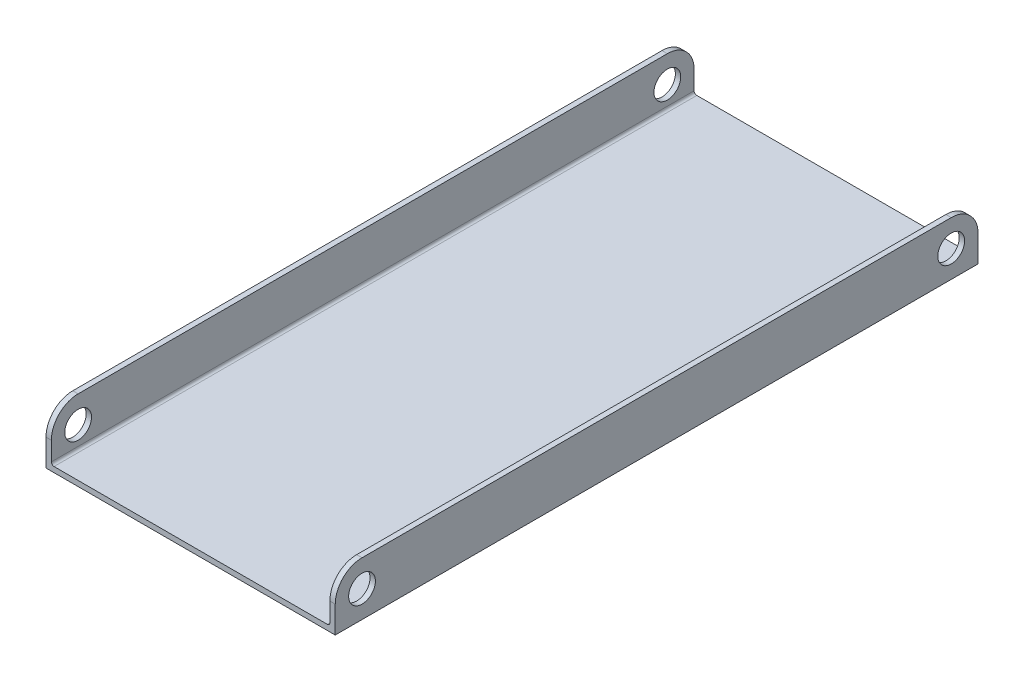
ISO-10303-21;
HEADER;
FILE_DESCRIPTION(('STEP AP214'),'2;1');
FILE_NAME('part.step','',(''),(''),'','','');
FILE_SCHEMA(('AUTOMOTIVE_DESIGN { 1 0 10303 214 1 1 1 1 }'));
ENDSEC;
DATA;
#1=APPLICATION_CONTEXT('core data for automotive mechanical design processes');
#2=APPLICATION_PROTOCOL_DEFINITION('international standard','automotive_design',2000,#1);
#3=PRODUCT_CONTEXT('',#1,'mechanical');
#4=PRODUCT('Part','Part','',(#3));
#5=PRODUCT_RELATED_PRODUCT_CATEGORY('part','',(#4));
#6=PRODUCT_DEFINITION_FORMATION('','',#4);
#7=PRODUCT_DEFINITION_CONTEXT('part definition',#1,'design');
#8=PRODUCT_DEFINITION('design','',#6,#7);
#9=PRODUCT_DEFINITION_SHAPE('','',#8);
#10=(LENGTH_UNIT() NAMED_UNIT(*) SI_UNIT(.MILLI.,.METRE.));
#11=(NAMED_UNIT(*) PLANE_ANGLE_UNIT() SI_UNIT($,.RADIAN.));
#12=(NAMED_UNIT(*) SI_UNIT($,.STERADIAN.) SOLID_ANGLE_UNIT());
#13=UNCERTAINTY_MEASURE_WITH_UNIT(LENGTH_MEASURE(1.E-05),#10,'distance_accuracy_value','');
#14=(GEOMETRIC_REPRESENTATION_CONTEXT(3) GLOBAL_UNCERTAINTY_ASSIGNED_CONTEXT((#13)) GLOBAL_UNIT_ASSIGNED_CONTEXT((#10,
#11,#12)) REPRESENTATION_CONTEXT('',''));
#15=CARTESIAN_POINT('',(0.,0.,0.));
#16=DIRECTION('',(0.,0.,1.));
#17=DIRECTION('',(1.,0.,0.));
#18=AXIS2_PLACEMENT_3D('',#15,#16,#17);
#19=CARTESIAN_POINT('',(0.,6.35,152.4));
#20=DIRECTION('',(0.,1.,0.));
#21=DIRECTION('',(0.,0.,1.));
#22=AXIS2_PLACEMENT_3D('',#19,#20,#21);
#23=PLANE('',#22);
#24=DIRECTION('',(1.,0.,0.));
#25=VECTOR('',#24,1.);
#26=CARTESIAN_POINT('',(-34.29,6.35,146.05));
#27=LINE('',#26,#25);
#28=CARTESIAN_POINT('',(33.02,6.35,146.05));
#29=VERTEX_POINT('',#28);
#30=CARTESIAN_POINT('',(34.29,6.35,146.05));
#31=VERTEX_POINT('',#30);
#32=EDGE_CURVE('E149',#29,#31,#27,.T.);
#33=ORIENTED_EDGE('',*,*,#32,.T.);
#34=DIRECTION('',(0.,0.,-1.));
#35=VECTOR('',#34,1.);
#36=CARTESIAN_POINT('',(34.29,6.35,152.4));
#37=LINE('',#36,#35);
#38=CARTESIAN_POINT('',(34.29,6.35,6.35000000000004));
#39=VERTEX_POINT('',#38);
#40=EDGE_CURVE('E165',#31,#39,#37,.T.);
#41=ORIENTED_EDGE('',*,*,#40,.T.);
#42=DIRECTION('',(1.,0.,0.));
#43=VECTOR('',#42,1.);
#44=CARTESIAN_POINT('',(-34.29,6.35,6.35000000000004));
#45=LINE('',#44,#43);
#46=CARTESIAN_POINT('',(33.02,6.35,6.35000000000004));
#47=VERTEX_POINT('',#46);
#48=EDGE_CURVE('E331',#47,#39,#45,.T.);
#49=ORIENTED_EDGE('',*,*,#48,.F.);
#50=DIRECTION('',(0.,0.,-1.));
#51=VECTOR('',#50,1.);
#52=CARTESIAN_POINT('',(33.02,6.35,152.4));
#53=LINE('',#52,#51);
#54=EDGE_CURVE('E167',#29,#47,#53,.T.);
#55=ORIENTED_EDGE('',*,*,#54,.F.);
#56=EDGE_LOOP('',(#33,#41,#49,#55));
#57=FACE_BOUND('',#56,.T.);
#58=ADVANCED_FACE('F45',(#57),#23,.T.);
#59=CARTESIAN_POINT('',(-34.29,6.35,146.05));
#60=VERTEX_POINT('',#59);
#61=CARTESIAN_POINT('',(-33.02,6.35,146.05));
#62=VERTEX_POINT('',#61);
#63=EDGE_CURVE('E169',#60,#62,#27,.T.);
#64=ORIENTED_EDGE('',*,*,#63,.T.);
#65=DIRECTION('',(0.,0.,-1.));
#66=VECTOR('',#65,1.);
#67=CARTESIAN_POINT('',(-33.02,6.35,152.4));
#68=LINE('',#67,#66);
#69=CARTESIAN_POINT('',(-33.02,6.35,6.35000000000004));
#70=VERTEX_POINT('',#69);
#71=EDGE_CURVE('E196',#62,#70,#68,.T.);
#72=ORIENTED_EDGE('',*,*,#71,.T.);
#73=CARTESIAN_POINT('',(-34.29,6.35,6.35000000000004));
#74=VERTEX_POINT('',#73);
#75=EDGE_CURVE('E325',#74,#70,#45,.T.);
#76=ORIENTED_EDGE('',*,*,#75,.F.);
#77=DIRECTION('',(0.,0.,-1.));
#78=VECTOR('',#77,1.);
#79=CARTESIAN_POINT('',(-34.29,6.35,152.4));
#80=LINE('',#79,#78);
#81=EDGE_CURVE('E192',#60,#74,#80,.T.);
#82=ORIENTED_EDGE('',*,*,#81,.F.);
#83=EDGE_LOOP('',(#64,#72,#76,#82));
#84=FACE_BOUND('',#83,.T.);
#85=ADVANCED_FACE('F379',(#84),#23,.T.);
#86=CARTESIAN_POINT('',(0.,0.,152.4));
#87=DIRECTION('',(0.,0.,1.));
#88=DIRECTION('',(1.,0.,0.));
#89=AXIS2_PLACEMENT_3D('',#86,#87,#88);
#90=PLANE('',#89);
#91=DIRECTION('',(0.,1.,0.));
#92=VECTOR('',#91,1.);
#93=CARTESIAN_POINT('',(34.29,0.,152.4));
#94=LINE('',#93,#92);
#95=CARTESIAN_POINT('',(34.29,-6.35,152.4));
#96=VERTEX_POINT('',#95);
#97=CARTESIAN_POINT('',(34.29,0.,152.4));
#98=VERTEX_POINT('',#97);
#99=EDGE_CURVE('E177',#96,#98,#94,.T.);
#100=ORIENTED_EDGE('',*,*,#99,.T.);
#101=DIRECTION('',(1.,0.,0.));
#102=VECTOR('',#101,1.);
#103=CARTESIAN_POINT('',(-34.29,0.,152.4));
#104=LINE('',#103,#102);
#105=CARTESIAN_POINT('',(33.02,0.,152.4));
#106=VERTEX_POINT('',#105);
#107=EDGE_CURVE('E152',#98,#106,#104,.F.);
#108=ORIENTED_EDGE('',*,*,#107,.T.);
#109=DIRECTION('',(0.,-1.,0.));
#110=VECTOR('',#109,1.);
#111=CARTESIAN_POINT('',(33.02,0.,152.4));
#112=LINE('',#111,#110);
#113=CARTESIAN_POINT('',(33.02,-4.445,152.4));
#114=VERTEX_POINT('',#113);
#115=EDGE_CURVE('E260',#106,#114,#112,.T.);
#116=ORIENTED_EDGE('',*,*,#115,.T.);
#117=CARTESIAN_POINT('',(32.385,-4.445,152.4));
#118=DIRECTION('',(0.,0.,1.));
#119=DIRECTION('',(1.,0.,0.));
#120=AXIS2_PLACEMENT_3D('',#117,#118,#119);
#121=CIRCLE('',#120,0.635);
#122=CARTESIAN_POINT('',(32.385,-5.08,152.4));
#123=VERTEX_POINT('',#122);
#124=EDGE_CURVE('E223',#114,#123,#121,.F.);
#125=ORIENTED_EDGE('',*,*,#124,.T.);
#126=DIRECTION('',(1.,0.,0.));
#127=VECTOR('',#126,1.);
#128=CARTESIAN_POINT('',(0.,-5.08,152.4));
#129=LINE('',#128,#127);
#130=CARTESIAN_POINT('',(-32.385,-5.08,152.4));
#131=VERTEX_POINT('',#130);
#132=EDGE_CURVE('E254',#131,#123,#129,.T.);
#133=ORIENTED_EDGE('',*,*,#132,.F.);
#134=CARTESIAN_POINT('',(-32.385,-4.445,152.4));
#135=DIRECTION('',(0.,0.,1.));
#136=DIRECTION('',(1.,0.,0.));
#137=AXIS2_PLACEMENT_3D('',#134,#135,#136);
#138=CIRCLE('',#137,0.635);
#139=CARTESIAN_POINT('',(-33.02,-4.445,152.4));
#140=VERTEX_POINT('',#139);
#141=EDGE_CURVE('E11',#131,#140,#138,.F.);
#142=ORIENTED_EDGE('',*,*,#141,.T.);
#143=DIRECTION('',(0.,-1.,0.));
#144=VECTOR('',#143,1.);
#145=CARTESIAN_POINT('',(-33.02,0.,152.4));
#146=LINE('',#145,#144);
#147=CARTESIAN_POINT('',(-33.02,0.,152.4));
#148=VERTEX_POINT('',#147);
#149=EDGE_CURVE('E248',#148,#140,#146,.T.);
#150=ORIENTED_EDGE('',*,*,#149,.F.);
#151=DIRECTION('',(1.,0.,0.));
#152=VECTOR('',#151,1.);
#153=CARTESIAN_POINT('',(-34.29,0.,152.4));
#154=LINE('',#153,#152);
#155=CARTESIAN_POINT('',(-34.29,0.,152.4));
#156=VERTEX_POINT('',#155);
#157=EDGE_CURVE('E337',#156,#148,#154,.T.);
#158=ORIENTED_EDGE('',*,*,#157,.F.);
#159=DIRECTION('',(0.,1.,0.));
#160=VECTOR('',#159,1.);
#161=CARTESIAN_POINT('',(-34.29,0.,152.4));
#162=LINE('',#161,#160);
#163=CARTESIAN_POINT('',(-34.29,-6.35,152.4));
#164=VERTEX_POINT('',#163);
#165=EDGE_CURVE('E253',#164,#156,#162,.T.);
#166=ORIENTED_EDGE('',*,*,#165,.F.);
#167=DIRECTION('',(1.,0.,0.));
#168=VECTOR('',#167,1.);
#169=CARTESIAN_POINT('',(0.,-6.35,152.4));
#170=LINE('',#169,#168);
#171=EDGE_CURVE('E184',#164,#96,#170,.T.);
#172=ORIENTED_EDGE('',*,*,#171,.T.);
#173=EDGE_LOOP('',(#100,#108,#116,#125,#133,#142,#150,#158,#166,#172));
#174=FACE_BOUND('',#173,.T.);
#175=ADVANCED_FACE('F377',(#174),#90,.T.);
#176=CARTESIAN_POINT('',(0.,0.,0.));
#177=DIRECTION('',(0.,0.,1.));
#178=DIRECTION('',(1.,0.,0.));
#179=AXIS2_PLACEMENT_3D('',#176,#177,#178);
#180=PLANE('',#179);
#181=DIRECTION('',(1.,0.,0.));
#182=VECTOR('',#181,1.);
#183=CARTESIAN_POINT('',(-34.29,0.,0.));
#184=LINE('',#183,#182);
#185=CARTESIAN_POINT('',(34.29,0.,0.));
#186=VERTEX_POINT('',#185);
#187=CARTESIAN_POINT('',(33.02,0.,0.));
#188=VERTEX_POINT('',#187);
#189=EDGE_CURVE('E202',#186,#188,#184,.F.);
#190=ORIENTED_EDGE('',*,*,#189,.F.);
#191=DIRECTION('',(0.,1.,0.));
#192=VECTOR('',#191,1.);
#193=CARTESIAN_POINT('',(34.29,0.,0.));
#194=LINE('',#193,#192);
#195=CARTESIAN_POINT('',(34.29,-6.35,0.));
#196=VERTEX_POINT('',#195);
#197=EDGE_CURVE('E187',#196,#186,#194,.T.);
#198=ORIENTED_EDGE('',*,*,#197,.F.);
#199=DIRECTION('',(1.,0.,0.));
#200=VECTOR('',#199,1.);
#201=CARTESIAN_POINT('',(0.,-6.35,0.));
#202=LINE('',#201,#200);
#203=CARTESIAN_POINT('',(-34.29,-6.35,0.));
#204=VERTEX_POINT('',#203);
#205=EDGE_CURVE('E275',#204,#196,#202,.T.);
#206=ORIENTED_EDGE('',*,*,#205,.F.);
#207=DIRECTION('',(0.,1.,0.));
#208=VECTOR('',#207,1.);
#209=CARTESIAN_POINT('',(-34.29,0.,0.));
#210=LINE('',#209,#208);
#211=CARTESIAN_POINT('',(-34.29,0.,0.));
#212=VERTEX_POINT('',#211);
#213=EDGE_CURVE('E272',#204,#212,#210,.T.);
#214=ORIENTED_EDGE('',*,*,#213,.T.);
#215=DIRECTION('',(1.,0.,0.));
#216=VECTOR('',#215,1.);
#217=CARTESIAN_POINT('',(-34.29,0.,0.));
#218=LINE('',#217,#216);
#219=CARTESIAN_POINT('',(-33.02,0.,0.));
#220=VERTEX_POINT('',#219);
#221=EDGE_CURVE('E328',#212,#220,#218,.T.);
#222=ORIENTED_EDGE('',*,*,#221,.T.);
#223=DIRECTION('',(0.,-1.,0.));
#224=VECTOR('',#223,1.);
#225=CARTESIAN_POINT('',(-33.02,0.,0.));
#226=LINE('',#225,#224);
#227=CARTESIAN_POINT('',(-33.02,-4.445,0.));
#228=VERTEX_POINT('',#227);
#229=EDGE_CURVE('E235',#220,#228,#226,.T.);
#230=ORIENTED_EDGE('',*,*,#229,.T.);
#231=CARTESIAN_POINT('',(-32.385,-4.445,0.));
#232=DIRECTION('',(0.,0.,1.));
#233=DIRECTION('',(1.,0.,0.));
#234=AXIS2_PLACEMENT_3D('',#231,#232,#233);
#235=CIRCLE('',#234,0.635);
#236=CARTESIAN_POINT('',(-32.385,-5.08,0.));
#237=VERTEX_POINT('',#236);
#238=EDGE_CURVE('E54',#228,#237,#235,.T.);
#239=ORIENTED_EDGE('',*,*,#238,.T.);
#240=DIRECTION('',(1.,0.,0.));
#241=VECTOR('',#240,1.);
#242=CARTESIAN_POINT('',(0.,-5.08,0.));
#243=LINE('',#242,#241);
#244=CARTESIAN_POINT('',(32.385,-5.08,0.));
#245=VERTEX_POINT('',#244);
#246=EDGE_CURVE('E232',#237,#245,#243,.T.);
#247=ORIENTED_EDGE('',*,*,#246,.T.);
#248=CARTESIAN_POINT('',(32.385,-4.445,0.));
#249=DIRECTION('',(0.,0.,1.));
#250=DIRECTION('',(1.,0.,0.));
#251=AXIS2_PLACEMENT_3D('',#248,#249,#250);
#252=CIRCLE('',#251,0.635);
#253=CARTESIAN_POINT('',(33.02,-4.445,0.));
#254=VERTEX_POINT('',#253);
#255=EDGE_CURVE('E220',#245,#254,#252,.T.);
#256=ORIENTED_EDGE('',*,*,#255,.T.);
#257=DIRECTION('',(0.,-1.,0.));
#258=VECTOR('',#257,1.);
#259=CARTESIAN_POINT('',(33.02,0.,0.));
#260=LINE('',#259,#258);
#261=EDGE_CURVE('E241',#188,#254,#260,.T.);
#262=ORIENTED_EDGE('',*,*,#261,.F.);
#263=EDGE_LOOP('',(#190,#198,#206,#214,#222,#230,#239,#247,#256,#262));
#264=FACE_BOUND('',#263,.T.);
#265=ADVANCED_FACE('F231',(#264),#180,.F.);
#266=CARTESIAN_POINT('',(33.02,0.,152.4));
#267=DIRECTION('',(1.,0.,0.));
#268=DIRECTION('',(0.,0.,-1.));
#269=AXIS2_PLACEMENT_3D('',#266,#267,#268);
#270=PLANE('',#269);
#271=CARTESIAN_POINT('',(33.02,0.,6.35000000000005));
#272=DIRECTION('',(1.,0.,0.));
#273=DIRECTION('',(0.,0.,-1.));
#274=AXIS2_PLACEMENT_3D('',#271,#272,#273);
#275=CIRCLE('',#274,3.175);
#276=CARTESIAN_POINT('',(33.02,0.,3.17500000000005));
#277=VERTEX_POINT('',#276);
#278=EDGE_CURVE('E268',#277,#277,#275,.T.);
#279=ORIENTED_EDGE('',*,*,#278,.T.);
#280=EDGE_LOOP('',(#279));
#281=FACE_BOUND('',#280,.T.);
#282=CARTESIAN_POINT('',(33.02,0.,146.05));
#283=DIRECTION('',(1.,0.,0.));
#284=DIRECTION('',(0.,0.,-1.));
#285=AXIS2_PLACEMENT_3D('',#282,#283,#284);
#286=CIRCLE('',#285,3.175);
#287=CARTESIAN_POINT('',(33.02,0.,142.875));
#288=VERTEX_POINT('',#287);
#289=EDGE_CURVE('E294',#288,#288,#286,.T.);
#290=ORIENTED_EDGE('',*,*,#289,.T.);
#291=EDGE_LOOP('',(#290));
#292=FACE_BOUND('',#291,.T.);
#293=ORIENTED_EDGE('',*,*,#261,.T.);
#294=DIRECTION('',(0.,0.,-1.));
#295=VECTOR('',#294,1.);
#296=CARTESIAN_POINT('',(33.02,-4.445,152.4));
#297=LINE('',#296,#295);
#298=EDGE_CURVE('E214',#254,#114,#297,.F.);
#299=ORIENTED_EDGE('',*,*,#298,.T.);
#300=ORIENTED_EDGE('',*,*,#115,.F.);
#301=CARTESIAN_POINT('',(33.02,0.,146.05));
#302=DIRECTION('',(1.,0.,0.));
#303=DIRECTION('',(0.,0.,-1.));
#304=AXIS2_PLACEMENT_3D('',#301,#302,#303);
#305=CIRCLE('',#304,6.35);
#306=EDGE_CURVE('E302',#106,#29,#305,.F.);
#307=ORIENTED_EDGE('',*,*,#306,.T.);
#308=ORIENTED_EDGE('',*,*,#54,.T.);
#309=CARTESIAN_POINT('',(33.02,0.,6.35));
#310=DIRECTION('',(1.,0.,0.));
#311=DIRECTION('',(0.,0.,-1.));
#312=AXIS2_PLACEMENT_3D('',#309,#310,#311);
#313=CIRCLE('',#312,6.35);
#314=EDGE_CURVE('E307',#47,#188,#313,.F.);
#315=ORIENTED_EDGE('',*,*,#314,.T.);
#316=EDGE_LOOP('',(#293,#299,#300,#307,#308,#315));
#317=FACE_BOUND('',#316,.T.);
#318=ADVANCED_FACE('F368',(#281,#292,#317),#270,.F.);
#319=CARTESIAN_POINT('',(0.,-5.08,152.4));
#320=DIRECTION('',(0.,1.,0.));
#321=DIRECTION('',(0.,0.,1.));
#322=AXIS2_PLACEMENT_3D('',#319,#320,#321);
#323=PLANE('',#322);
#324=ORIENTED_EDGE('',*,*,#132,.T.);
#325=DIRECTION('',(0.,0.,-1.));
#326=VECTOR('',#325,1.);
#327=CARTESIAN_POINT('',(32.385,-5.08,152.4));
#328=LINE('',#327,#326);
#329=EDGE_CURVE('E210',#123,#245,#328,.T.);
#330=ORIENTED_EDGE('',*,*,#329,.T.);
#331=ORIENTED_EDGE('',*,*,#246,.F.);
#332=DIRECTION('',(0.,0.,-1.));
#333=VECTOR('',#332,1.);
#334=CARTESIAN_POINT('',(-32.385,-5.08,152.4));
#335=LINE('',#334,#333);
#336=EDGE_CURVE('E207',#237,#131,#335,.F.);
#337=ORIENTED_EDGE('',*,*,#336,.T.);
#338=EDGE_LOOP('',(#324,#330,#331,#337));
#339=FACE_BOUND('',#338,.T.);
#340=ADVANCED_FACE('F238',(#339),#323,.T.);
#341=CARTESIAN_POINT('',(-33.02,0.,152.4));
#342=DIRECTION('',(1.,0.,0.));
#343=DIRECTION('',(0.,0.,-1.));
#344=AXIS2_PLACEMENT_3D('',#341,#342,#343);
#345=PLANE('',#344);
#346=ORIENTED_EDGE('',*,*,#149,.T.);
#347=DIRECTION('',(0.,0.,-1.));
#348=VECTOR('',#347,1.);
#349=CARTESIAN_POINT('',(-33.02,-4.445,0.));
#350=LINE('',#349,#348);
#351=EDGE_CURVE('E217',#140,#228,#350,.T.);
#352=ORIENTED_EDGE('',*,*,#351,.T.);
#353=ORIENTED_EDGE('',*,*,#229,.F.);
#354=CARTESIAN_POINT('',(-33.02,0.,6.35));
#355=DIRECTION('',(1.,0.,0.));
#356=DIRECTION('',(0.,0.,-1.));
#357=AXIS2_PLACEMENT_3D('',#354,#355,#356);
#358=CIRCLE('',#357,6.35);
#359=EDGE_CURVE('E311',#70,#220,#358,.F.);
#360=ORIENTED_EDGE('',*,*,#359,.F.);
#361=ORIENTED_EDGE('',*,*,#71,.F.);
#362=CARTESIAN_POINT('',(-33.02,0.,146.05));
#363=DIRECTION('',(1.,0.,0.));
#364=DIRECTION('',(0.,0.,-1.));
#365=AXIS2_PLACEMENT_3D('',#362,#363,#364);
#366=CIRCLE('',#365,6.35);
#367=EDGE_CURVE('E250',#148,#62,#366,.F.);
#368=ORIENTED_EDGE('',*,*,#367,.F.);
#369=EDGE_LOOP('',(#346,#352,#353,#360,#361,#368));
#370=FACE_BOUND('',#369,.T.);
#371=CARTESIAN_POINT('',(-33.02,0.,6.35000000000005));
#372=DIRECTION('',(1.,0.,0.));
#373=DIRECTION('',(0.,0.,-1.));
#374=AXIS2_PLACEMENT_3D('',#371,#372,#373);
#375=CIRCLE('',#374,3.175);
#376=CARTESIAN_POINT('',(-33.02,0.,3.17500000000005));
#377=VERTEX_POINT('',#376);
#378=EDGE_CURVE('E290',#377,#377,#375,.T.);
#379=ORIENTED_EDGE('',*,*,#378,.F.);
#380=EDGE_LOOP('',(#379));
#381=FACE_BOUND('',#380,.T.);
#382=CARTESIAN_POINT('',(-33.02,0.,146.05));
#383=DIRECTION('',(1.,0.,0.));
#384=DIRECTION('',(0.,0.,-1.));
#385=AXIS2_PLACEMENT_3D('',#382,#383,#384);
#386=CIRCLE('',#385,3.175);
#387=CARTESIAN_POINT('',(-33.02,0.,142.875));
#388=VERTEX_POINT('',#387);
#389=EDGE_CURVE('E298',#388,#388,#386,.T.);
#390=ORIENTED_EDGE('',*,*,#389,.F.);
#391=EDGE_LOOP('',(#390));
#392=FACE_BOUND('',#391,.T.);
#393=ADVANCED_FACE('F244',(#370,#381,#392),#345,.T.);
#394=CARTESIAN_POINT('',(-34.29,0.,152.4));
#395=DIRECTION('',(-1.,0.,0.));
#396=DIRECTION('',(0.,0.,1.));
#397=AXIS2_PLACEMENT_3D('',#394,#395,#396);
#398=PLANE('',#397);
#399=CARTESIAN_POINT('',(-34.29,0.,146.05));
#400=DIRECTION('',(-1.,0.,0.));
#401=DIRECTION('',(0.,0.,-1.));
#402=AXIS2_PLACEMENT_3D('',#399,#400,#401);
#403=CIRCLE('',#402,6.35);
#404=EDGE_CURVE('E159',#156,#60,#403,.T.);
#405=ORIENTED_EDGE('',*,*,#404,.T.);
#406=ORIENTED_EDGE('',*,*,#81,.T.);
#407=CARTESIAN_POINT('',(-34.29,0.,6.35));
#408=DIRECTION('',(-1.,0.,0.));
#409=DIRECTION('',(0.,0.,-1.));
#410=AXIS2_PLACEMENT_3D('',#407,#408,#409);
#411=CIRCLE('',#410,6.35);
#412=EDGE_CURVE('E321',#74,#212,#411,.T.);
#413=ORIENTED_EDGE('',*,*,#412,.T.);
#414=ORIENTED_EDGE('',*,*,#213,.F.);
#415=DIRECTION('',(0.,0.,-1.));
#416=VECTOR('',#415,1.);
#417=CARTESIAN_POINT('',(-34.29,-6.35,152.4));
#418=LINE('',#417,#416);
#419=EDGE_CURVE('E182',#164,#204,#418,.T.);
#420=ORIENTED_EDGE('',*,*,#419,.F.);
#421=ORIENTED_EDGE('',*,*,#165,.T.);
#422=EDGE_LOOP('',(#405,#406,#413,#414,#420,#421));
#423=FACE_BOUND('',#422,.T.);
#424=CARTESIAN_POINT('',(-34.29,0.,6.35000000000005));
#425=DIRECTION('',(1.,0.,0.));
#426=DIRECTION('',(0.,0.,1.));
#427=AXIS2_PLACEMENT_3D('',#424,#425,#426);
#428=CIRCLE('',#427,3.175);
#429=CARTESIAN_POINT('',(-34.29,0.,9.52500000000005));
#430=VERTEX_POINT('',#429);
#431=EDGE_CURVE('E343',#430,#430,#428,.T.);
#432=ORIENTED_EDGE('',*,*,#431,.T.);
#433=EDGE_LOOP('',(#432));
#434=FACE_BOUND('',#433,.T.);
#435=CARTESIAN_POINT('',(-34.29,0.,146.05));
#436=DIRECTION('',(1.,0.,0.));
#437=DIRECTION('',(0.,0.,-1.));
#438=AXIS2_PLACEMENT_3D('',#435,#436,#437);
#439=CIRCLE('',#438,3.175);
#440=CARTESIAN_POINT('',(-34.29,0.,142.875));
#441=VERTEX_POINT('',#440);
#442=EDGE_CURVE('E314',#441,#441,#439,.T.);
#443=ORIENTED_EDGE('',*,*,#442,.T.);
#444=EDGE_LOOP('',(#443));
#445=FACE_BOUND('',#444,.T.);
#446=ADVANCED_FACE('F393',(#423,#434,#445),#398,.T.);
#447=CARTESIAN_POINT('',(0.,-6.35,152.4));
#448=DIRECTION('',(0.,1.,0.));
#449=DIRECTION('',(0.,0.,1.));
#450=AXIS2_PLACEMENT_3D('',#447,#448,#449);
#451=PLANE('',#450);
#452=ORIENTED_EDGE('',*,*,#205,.T.);
#453=DIRECTION('',(0.,0.,-1.));
#454=VECTOR('',#453,1.);
#455=CARTESIAN_POINT('',(34.29,-6.35,152.4));
#456=LINE('',#455,#454);
#457=EDGE_CURVE('E176',#96,#196,#456,.T.);
#458=ORIENTED_EDGE('',*,*,#457,.F.);
#459=ORIENTED_EDGE('',*,*,#171,.F.);
#460=ORIENTED_EDGE('',*,*,#419,.T.);
#461=EDGE_LOOP('',(#452,#458,#459,#460));
#462=FACE_BOUND('',#461,.T.);
#463=ADVANCED_FACE('F357',(#462),#451,.F.);
#464=CARTESIAN_POINT('',(34.29,0.,152.4));
#465=DIRECTION('',(-1.,0.,0.));
#466=DIRECTION('',(0.,0.,1.));
#467=AXIS2_PLACEMENT_3D('',#464,#465,#466);
#468=PLANE('',#467);
#469=CARTESIAN_POINT('',(34.29,0.,6.35000000000005));
#470=DIRECTION('',(1.,0.,0.));
#471=DIRECTION('',(0.,0.,1.));
#472=AXIS2_PLACEMENT_3D('',#469,#470,#471);
#473=CIRCLE('',#472,3.175);
#474=CARTESIAN_POINT('',(34.29,0.,9.52500000000005));
#475=VERTEX_POINT('',#474);
#476=EDGE_CURVE('E332',#475,#475,#473,.T.);
#477=ORIENTED_EDGE('',*,*,#476,.F.);
#478=EDGE_LOOP('',(#477));
#479=FACE_BOUND('',#478,.T.);
#480=CARTESIAN_POINT('',(34.29,0.,146.05));
#481=DIRECTION('',(1.,0.,0.));
#482=DIRECTION('',(0.,0.,-1.));
#483=AXIS2_PLACEMENT_3D('',#480,#481,#482);
#484=CIRCLE('',#483,3.175);
#485=CARTESIAN_POINT('',(34.29,0.,142.875));
#486=VERTEX_POINT('',#485);
#487=EDGE_CURVE('E158',#486,#486,#484,.T.);
#488=ORIENTED_EDGE('',*,*,#487,.F.);
#489=EDGE_LOOP('',(#488));
#490=FACE_BOUND('',#489,.T.);
#491=ORIENTED_EDGE('',*,*,#40,.F.);
#492=CARTESIAN_POINT('',(34.29,0.,146.05));
#493=DIRECTION('',(-1.,0.,0.));
#494=DIRECTION('',(0.,0.,-1.));
#495=AXIS2_PLACEMENT_3D('',#492,#493,#494);
#496=CIRCLE('',#495,6.35);
#497=EDGE_CURVE('E146',#98,#31,#496,.T.);
#498=ORIENTED_EDGE('',*,*,#497,.F.);
#499=ORIENTED_EDGE('',*,*,#99,.F.);
#500=ORIENTED_EDGE('',*,*,#457,.T.);
#501=ORIENTED_EDGE('',*,*,#197,.T.);
#502=CARTESIAN_POINT('',(34.29,0.,6.35));
#503=DIRECTION('',(-1.,0.,0.));
#504=DIRECTION('',(0.,0.,-1.));
#505=AXIS2_PLACEMENT_3D('',#502,#503,#504);
#506=CIRCLE('',#505,6.35);
#507=EDGE_CURVE('E170',#39,#186,#506,.T.);
#508=ORIENTED_EDGE('',*,*,#507,.F.);
#509=EDGE_LOOP('',(#491,#498,#499,#500,#501,#508));
#510=FACE_BOUND('',#509,.T.);
#511=ADVANCED_FACE('F173',(#479,#490,#510),#468,.F.);
#512=CARTESIAN_POINT('',(-34.29,0.,6.35));
#513=DIRECTION('',(1.,0.,0.));
#514=DIRECTION('',(0.,0.,-1.));
#515=AXIS2_PLACEMENT_3D('',#512,#513,#514);
#516=CYLINDRICAL_SURFACE('',#515,6.35);
#517=ORIENTED_EDGE('',*,*,#359,.T.);
#518=ORIENTED_EDGE('',*,*,#221,.F.);
#519=ORIENTED_EDGE('',*,*,#412,.F.);
#520=ORIENTED_EDGE('',*,*,#75,.T.);
#521=EDGE_LOOP('',(#517,#518,#519,#520));
#522=FACE_BOUND('',#521,.T.);
#523=ADVANCED_FACE('F356',(#522),#516,.T.);
#524=ORIENTED_EDGE('',*,*,#48,.T.);
#525=ORIENTED_EDGE('',*,*,#507,.T.);
#526=ORIENTED_EDGE('',*,*,#189,.T.);
#527=ORIENTED_EDGE('',*,*,#314,.F.);
#528=EDGE_LOOP('',(#524,#525,#526,#527));
#529=FACE_BOUND('',#528,.T.);
#530=ADVANCED_FACE('F506',(#529),#516,.T.);
#531=CARTESIAN_POINT('',(-34.29,0.,146.05));
#532=DIRECTION('',(1.,0.,0.));
#533=DIRECTION('',(0.,0.,-1.));
#534=AXIS2_PLACEMENT_3D('',#531,#532,#533);
#535=CYLINDRICAL_SURFACE('',#534,6.35);
#536=ORIENTED_EDGE('',*,*,#367,.T.);
#537=ORIENTED_EDGE('',*,*,#63,.F.);
#538=ORIENTED_EDGE('',*,*,#404,.F.);
#539=ORIENTED_EDGE('',*,*,#157,.T.);
#540=EDGE_LOOP('',(#536,#537,#538,#539));
#541=FACE_BOUND('',#540,.T.);
#542=ADVANCED_FACE('F498',(#541),#535,.T.);
#543=ORIENTED_EDGE('',*,*,#107,.F.);
#544=ORIENTED_EDGE('',*,*,#497,.T.);
#545=ORIENTED_EDGE('',*,*,#32,.F.);
#546=ORIENTED_EDGE('',*,*,#306,.F.);
#547=EDGE_LOOP('',(#543,#544,#545,#546));
#548=FACE_BOUND('',#547,.T.);
#549=ADVANCED_FACE('F148',(#548),#535,.T.);
#550=CARTESIAN_POINT('',(-34.29,0.,146.05));
#551=DIRECTION('',(1.,0.,0.));
#552=DIRECTION('',(0.,0.,-1.));
#553=AXIS2_PLACEMENT_3D('',#550,#551,#552);
#554=CYLINDRICAL_SURFACE('',#553,3.175);
#555=ORIENTED_EDGE('',*,*,#487,.T.);
#556=EDGE_LOOP('',(#555));
#557=FACE_BOUND('',#556,.T.);
#558=ORIENTED_EDGE('',*,*,#289,.F.);
#559=EDGE_LOOP('',(#558));
#560=FACE_BOUND('',#559,.T.);
#561=ADVANCED_FACE('F361',(#557,#560),#554,.F.);
#562=CARTESIAN_POINT('',(-34.29,0.,6.35000000000005));
#563=DIRECTION('',(1.,0.,0.));
#564=DIRECTION('',(0.,0.,-1.));
#565=AXIS2_PLACEMENT_3D('',#562,#563,#564);
#566=CYLINDRICAL_SURFACE('',#565,3.175);
#567=ORIENTED_EDGE('',*,*,#476,.T.);
#568=EDGE_LOOP('',(#567));
#569=FACE_BOUND('',#568,.T.);
#570=ORIENTED_EDGE('',*,*,#278,.F.);
#571=EDGE_LOOP('',(#570));
#572=FACE_BOUND('',#571,.T.);
#573=ADVANCED_FACE('F351',(#569,#572),#566,.F.);
#574=ORIENTED_EDGE('',*,*,#389,.T.);
#575=EDGE_LOOP('',(#574));
#576=FACE_BOUND('',#575,.T.);
#577=ORIENTED_EDGE('',*,*,#442,.F.);
#578=EDGE_LOOP('',(#577));
#579=FACE_BOUND('',#578,.T.);
#580=ADVANCED_FACE('F365',(#576,#579),#554,.F.);
#581=ORIENTED_EDGE('',*,*,#378,.T.);
#582=EDGE_LOOP('',(#581));
#583=FACE_BOUND('',#582,.T.);
#584=ORIENTED_EDGE('',*,*,#431,.F.);
#585=EDGE_LOOP('',(#584));
#586=FACE_BOUND('',#585,.T.);
#587=ADVANCED_FACE('F399',(#583,#586),#566,.F.);
#588=CARTESIAN_POINT('',(32.385,-4.445,152.4));
#589=DIRECTION('',(0.,0.,-1.));
#590=DIRECTION('',(-1.,0.,0.));
#591=AXIS2_PLACEMENT_3D('',#588,#589,#590);
#592=CYLINDRICAL_SURFACE('',#591,0.635);
#593=ORIENTED_EDGE('',*,*,#124,.F.);
#594=ORIENTED_EDGE('',*,*,#298,.F.);
#595=ORIENTED_EDGE('',*,*,#255,.F.);
#596=ORIENTED_EDGE('',*,*,#329,.F.);
#597=EDGE_LOOP('',(#593,#594,#595,#596));
#598=FACE_BOUND('',#597,.T.);
#599=ADVANCED_FACE('F376',(#598),#592,.F.);
#600=CARTESIAN_POINT('',(-32.385,-4.445,152.4));
#601=DIRECTION('',(0.,0.,1.));
#602=DIRECTION('',(1.,0.,0.));
#603=AXIS2_PLACEMENT_3D('',#600,#601,#602);
#604=CYLINDRICAL_SURFACE('',#603,0.635);
#605=ORIENTED_EDGE('',*,*,#141,.F.);
#606=ORIENTED_EDGE('',*,*,#336,.F.);
#607=ORIENTED_EDGE('',*,*,#238,.F.);
#608=ORIENTED_EDGE('',*,*,#351,.F.);
#609=EDGE_LOOP('',(#605,#606,#607,#608));
#610=FACE_BOUND('',#609,.T.);
#611=ADVANCED_FACE('F47',(#610),#604,.F.);
#612=CLOSED_SHELL('',(#58,#85,#175,#265,#318,#340,#393,#446,#463,#511,#523,#530,#542,#549,#561,
#573,#580,#587,#599,#611));
#613=MANIFOLD_SOLID_BREP('B2',#612);
#614=ADVANCED_BREP_SHAPE_REPRESENTATION('',(#18,#613),#14);
#615=SHAPE_DEFINITION_REPRESENTATION(#9,#614);
ENDSEC;
END-ISO-10303-21;
